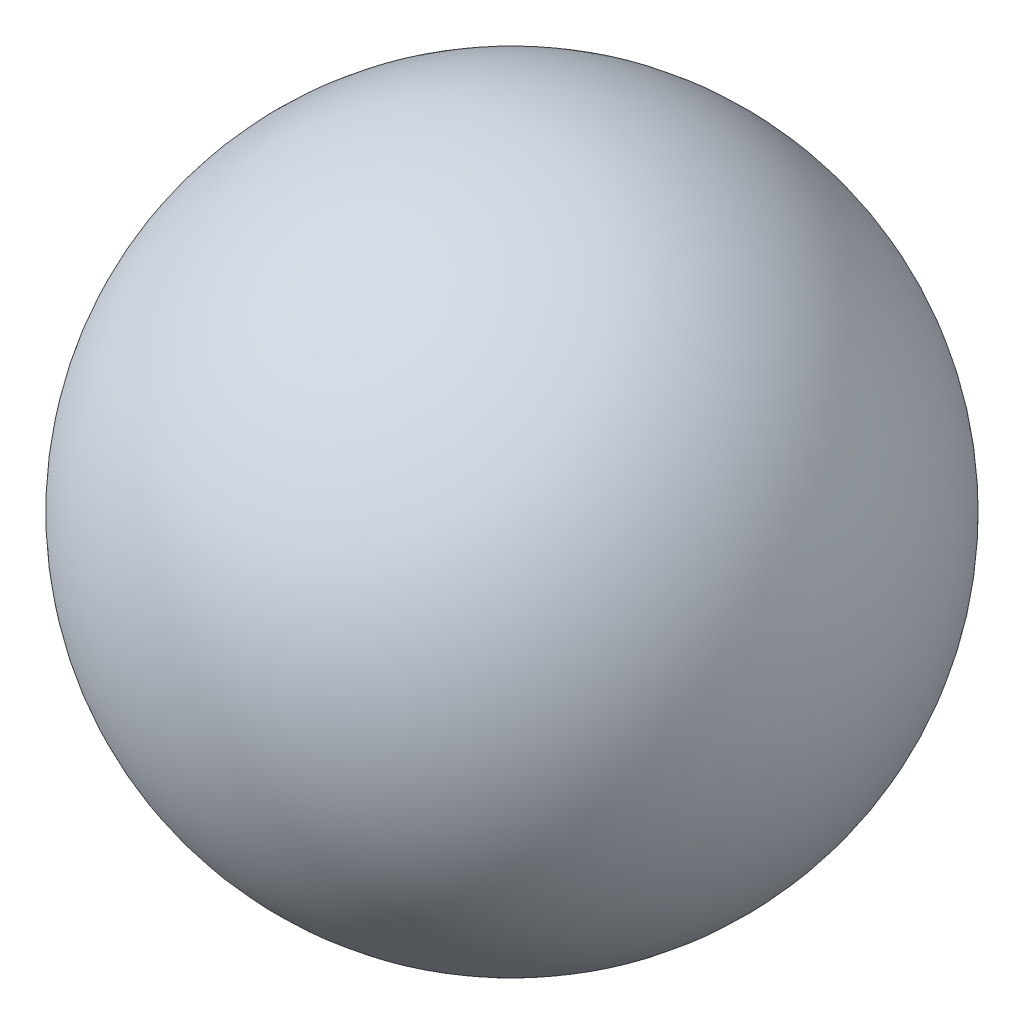
ISO-10303-21;
HEADER;
FILE_DESCRIPTION(('STEP AP214'),'2;1');
FILE_NAME('part.step','',(''),(''),'','','');
FILE_SCHEMA(('AUTOMOTIVE_DESIGN { 1 0 10303 214 1 1 1 1 }'));
ENDSEC;
DATA;
#1=APPLICATION_CONTEXT('core data for automotive mechanical design processes');
#2=APPLICATION_PROTOCOL_DEFINITION('international standard','automotive_design',2000,#1);
#3=PRODUCT_CONTEXT('',#1,'mechanical');
#4=PRODUCT('Part','Part','',(#3));
#5=PRODUCT_RELATED_PRODUCT_CATEGORY('part','',(#4));
#6=PRODUCT_DEFINITION_FORMATION('','',#4);
#7=PRODUCT_DEFINITION_CONTEXT('part definition',#1,'design');
#8=PRODUCT_DEFINITION('design','',#6,#7);
#9=PRODUCT_DEFINITION_SHAPE('','',#8);
#10=(LENGTH_UNIT() NAMED_UNIT(*) SI_UNIT(.MILLI.,.METRE.));
#11=(NAMED_UNIT(*) PLANE_ANGLE_UNIT() SI_UNIT($,.RADIAN.));
#12=(NAMED_UNIT(*) SI_UNIT($,.STERADIAN.) SOLID_ANGLE_UNIT());
#13=UNCERTAINTY_MEASURE_WITH_UNIT(LENGTH_MEASURE(1.E-05),#10,'distance_accuracy_value','');
#14=(GEOMETRIC_REPRESENTATION_CONTEXT(3) GLOBAL_UNCERTAINTY_ASSIGNED_CONTEXT((#13)) GLOBAL_UNIT_ASSIGNED_CONTEXT((#10,
#11,#12)) REPRESENTATION_CONTEXT('',''));
#15=CARTESIAN_POINT('',(0.,0.,0.));
#16=DIRECTION('',(0.,0.,1.));
#17=DIRECTION('',(1.,0.,0.));
#18=AXIS2_PLACEMENT_3D('',#15,#16,#17);
#19=CARTESIAN_POINT('',(0.,39.341527632951,0.));
#20=DIRECTION('',(0.,-1.,0.));
#21=DIRECTION('',(-1.,0.,0.));
#22=AXIS2_PLACEMENT_3D('',#19,#20,#21);
#23=SPHERICAL_SURFACE('',#22,28.6478362877998);
#24=CARTESIAN_POINT('',(0.,10.6936913451512,0.));
#25=VERTEX_POINT('',#24);
#26=VERTEX_LOOP('',#25);
#27=FACE_BOUND('',#26,.T.);
#28=ADVANCED_FACE('F29',(#27),#23,.T.);
#29=CLOSED_SHELL('',(#28));
#30=MANIFOLD_SOLID_BREP('B2',#29);
#31=ADVANCED_BREP_SHAPE_REPRESENTATION('',(#18,#30),#14);
#32=SHAPE_DEFINITION_REPRESENTATION(#9,#31);
ENDSEC;
END-ISO-10303-21;
